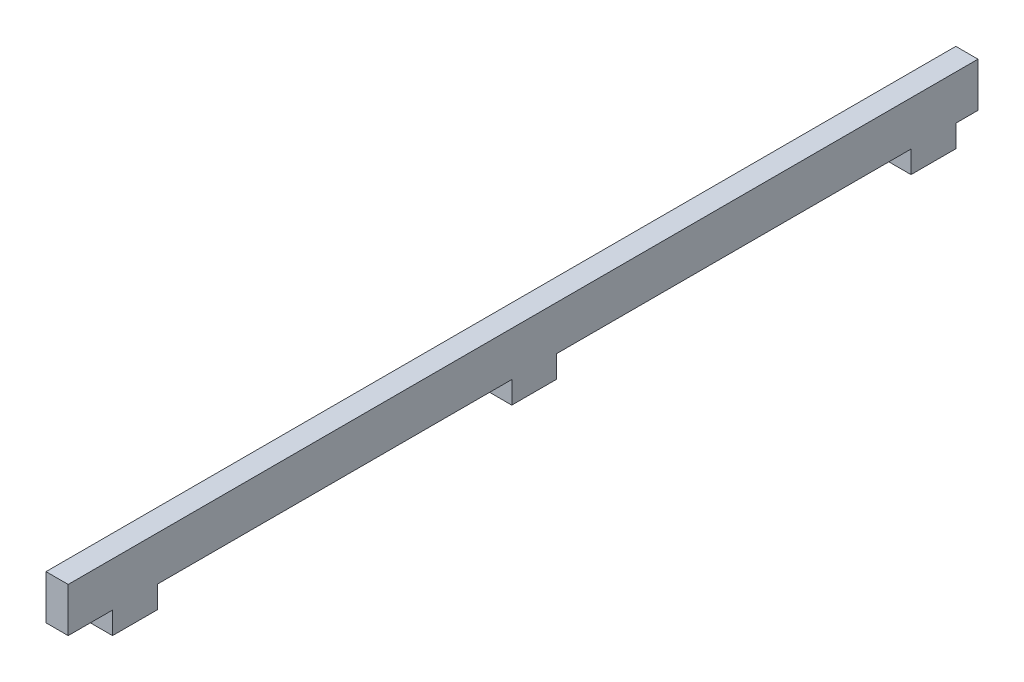
ISO-10303-21;
HEADER;
FILE_DESCRIPTION(('STEP AP214'),'2;1');
FILE_NAME('part.step','',(''),(''),'','','');
FILE_SCHEMA(('AUTOMOTIVE_DESIGN { 1 0 10303 214 1 1 1 1 }'));
ENDSEC;
DATA;
#1=APPLICATION_CONTEXT('core data for automotive mechanical design processes');
#2=APPLICATION_PROTOCOL_DEFINITION('international standard','automotive_design',2000,#1);
#3=PRODUCT_CONTEXT('',#1,'mechanical');
#4=PRODUCT('Part','Part','',(#3));
#5=PRODUCT_RELATED_PRODUCT_CATEGORY('part','',(#4));
#6=PRODUCT_DEFINITION_FORMATION('','',#4);
#7=PRODUCT_DEFINITION_CONTEXT('part definition',#1,'design');
#8=PRODUCT_DEFINITION('design','',#6,#7);
#9=PRODUCT_DEFINITION_SHAPE('','',#8);
#10=(LENGTH_UNIT() NAMED_UNIT(*) SI_UNIT(.MILLI.,.METRE.));
#11=(NAMED_UNIT(*) PLANE_ANGLE_UNIT() SI_UNIT($,.RADIAN.));
#12=(NAMED_UNIT(*) SI_UNIT($,.STERADIAN.) SOLID_ANGLE_UNIT());
#13=UNCERTAINTY_MEASURE_WITH_UNIT(LENGTH_MEASURE(1.E-05),#10,'distance_accuracy_value','');
#14=(GEOMETRIC_REPRESENTATION_CONTEXT(3) GLOBAL_UNCERTAINTY_ASSIGNED_CONTEXT((#13)) GLOBAL_UNIT_ASSIGNED_CONTEXT((#10,
#11,#12)) REPRESENTATION_CONTEXT('',''));
#15=CARTESIAN_POINT('',(0.,0.,0.));
#16=DIRECTION('',(0.,0.,1.));
#17=DIRECTION('',(1.,0.,0.));
#18=AXIS2_PLACEMENT_3D('',#15,#16,#17);
#19=CARTESIAN_POINT('',(6.35,0.,0.));
#20=DIRECTION('',(0.,-1.,0.));
#21=DIRECTION('',(0.,0.,-1.));
#22=AXIS2_PLACEMENT_3D('',#19,#20,#21);
#23=PLANE('',#22);
#24=DIRECTION('',(0.,0.,1.));
#25=VECTOR('',#24,1.);
#26=CARTESIAN_POINT('',(0.,0.,0.));
#27=LINE('',#26,#25);
#28=CARTESIAN_POINT('',(0.,0.,-260.477));
#29=VERTEX_POINT('',#28);
#30=CARTESIAN_POINT('',(0.,0.,0.));
#31=VERTEX_POINT('',#30);
#32=EDGE_CURVE('E179',#29,#31,#27,.T.);
#33=ORIENTED_EDGE('',*,*,#32,.T.);
#34=DIRECTION('',(-1.,0.,0.));
#35=VECTOR('',#34,1.);
#36=CARTESIAN_POINT('',(6.35,0.,0.));
#37=LINE('',#36,#35);
#38=CARTESIAN_POINT('',(6.35,0.,0.));
#39=VERTEX_POINT('',#38);
#40=EDGE_CURVE('E11',#39,#31,#37,.T.);
#41=ORIENTED_EDGE('',*,*,#40,.F.);
#42=DIRECTION('',(0.,0.,1.));
#43=VECTOR('',#42,1.);
#44=CARTESIAN_POINT('',(6.35,0.,0.));
#45=LINE('',#44,#43);
#46=CARTESIAN_POINT('',(6.35,0.,-260.477));
#47=VERTEX_POINT('',#46);
#48=EDGE_CURVE('E209',#47,#39,#45,.T.);
#49=ORIENTED_EDGE('',*,*,#48,.F.);
#50=DIRECTION('',(-1.,0.,0.));
#51=VECTOR('',#50,1.);
#52=CARTESIAN_POINT('',(6.35,0.,-260.477));
#53=LINE('',#52,#51);
#54=EDGE_CURVE('E175',#47,#29,#53,.T.);
#55=ORIENTED_EDGE('',*,*,#54,.T.);
#56=EDGE_LOOP('',(#33,#41,#49,#55));
#57=FACE_BOUND('',#56,.T.);
#58=ADVANCED_FACE('F35',(#57),#23,.F.);
#59=CARTESIAN_POINT('',(6.35,0.,0.));
#60=DIRECTION('',(0.,0.,-1.));
#61=DIRECTION('',(0.,1.,0.));
#62=AXIS2_PLACEMENT_3D('',#59,#60,#61);
#63=PLANE('',#62);
#64=DIRECTION('',(0.,-1.,0.));
#65=VECTOR('',#64,1.);
#66=CARTESIAN_POINT('',(0.,0.,0.));
#67=LINE('',#66,#65);
#68=CARTESIAN_POINT('',(0.,-12.7,0.));
#69=VERTEX_POINT('',#68);
#70=EDGE_CURVE('E182',#31,#69,#67,.T.);
#71=ORIENTED_EDGE('',*,*,#70,.T.);
#72=DIRECTION('',(-1.,0.,0.));
#73=VECTOR('',#72,1.);
#74=CARTESIAN_POINT('',(6.35,-12.7,0.));
#75=LINE('',#74,#73);
#76=CARTESIAN_POINT('',(6.35,-12.7,0.));
#77=VERTEX_POINT('',#76);
#78=EDGE_CURVE('E43',#77,#69,#75,.T.);
#79=ORIENTED_EDGE('',*,*,#78,.F.);
#80=DIRECTION('',(0.,-1.,0.));
#81=VECTOR('',#80,1.);
#82=CARTESIAN_POINT('',(6.35,0.,0.));
#83=LINE('',#82,#81);
#84=EDGE_CURVE('E118',#39,#77,#83,.T.);
#85=ORIENTED_EDGE('',*,*,#84,.F.);
#86=ORIENTED_EDGE('',*,*,#40,.T.);
#87=EDGE_LOOP('',(#71,#79,#85,#86));
#88=FACE_BOUND('',#87,.T.);
#89=ADVANCED_FACE('F307',(#88),#63,.F.);
#90=CARTESIAN_POINT('',(6.35,-12.7,0.));
#91=DIRECTION('',(0.,1.,0.));
#92=DIRECTION('',(0.,0.,1.));
#93=AXIS2_PLACEMENT_3D('',#90,#91,#92);
#94=PLANE('',#93);
#95=DIRECTION('',(0.,0.,-1.));
#96=VECTOR('',#95,1.);
#97=CARTESIAN_POINT('',(0.,-12.7,0.));
#98=LINE('',#97,#96);
#99=CARTESIAN_POINT('',(0.,-12.7,-12.7));
#100=VERTEX_POINT('',#99);
#101=EDGE_CURVE('E184',#69,#100,#98,.T.);
#102=ORIENTED_EDGE('',*,*,#101,.T.);
#103=DIRECTION('',(-1.,0.,0.));
#104=VECTOR('',#103,1.);
#105=CARTESIAN_POINT('',(6.35,-12.7,-12.7));
#106=LINE('',#105,#104);
#107=CARTESIAN_POINT('',(6.35,-12.7,-12.7));
#108=VERTEX_POINT('',#107);
#109=EDGE_CURVE('E240',#108,#100,#106,.T.);
#110=ORIENTED_EDGE('',*,*,#109,.F.);
#111=DIRECTION('',(0.,0.,-1.));
#112=VECTOR('',#111,1.);
#113=CARTESIAN_POINT('',(6.35,-12.7,0.));
#114=LINE('',#113,#112);
#115=EDGE_CURVE('E248',#77,#108,#114,.T.);
#116=ORIENTED_EDGE('',*,*,#115,.F.);
#117=ORIENTED_EDGE('',*,*,#78,.T.);
#118=EDGE_LOOP('',(#102,#110,#116,#117));
#119=FACE_BOUND('',#118,.T.);
#120=ADVANCED_FACE('F246',(#119),#94,.F.);
#121=CARTESIAN_POINT('',(6.35,-12.7,-12.7));
#122=DIRECTION('',(0.,0.,-1.));
#123=DIRECTION('',(0.,1.,0.));
#124=AXIS2_PLACEMENT_3D('',#121,#122,#123);
#125=PLANE('',#124);
#126=DIRECTION('',(0.,-1.,0.));
#127=VECTOR('',#126,1.);
#128=CARTESIAN_POINT('',(0.,-12.7,-12.7));
#129=LINE('',#128,#127);
#130=CARTESIAN_POINT('',(0.,-19.05,-12.7));
#131=VERTEX_POINT('',#130);
#132=EDGE_CURVE('E186',#100,#131,#129,.T.);
#133=ORIENTED_EDGE('',*,*,#132,.T.);
#134=DIRECTION('',(-1.,0.,0.));
#135=VECTOR('',#134,1.);
#136=CARTESIAN_POINT('',(6.35,-19.05,-12.7));
#137=LINE('',#136,#135);
#138=CARTESIAN_POINT('',(6.35,-19.05,-12.7));
#139=VERTEX_POINT('',#138);
#140=EDGE_CURVE('E237',#139,#131,#137,.T.);
#141=ORIENTED_EDGE('',*,*,#140,.F.);
#142=DIRECTION('',(0.,-1.,0.));
#143=VECTOR('',#142,1.);
#144=CARTESIAN_POINT('',(6.35,-12.7,-12.7));
#145=LINE('',#144,#143);
#146=EDGE_CURVE('E266',#108,#139,#145,.T.);
#147=ORIENTED_EDGE('',*,*,#146,.F.);
#148=ORIENTED_EDGE('',*,*,#109,.T.);
#149=EDGE_LOOP('',(#133,#141,#147,#148));
#150=FACE_BOUND('',#149,.T.);
#151=ADVANCED_FACE('F257',(#150),#125,.F.);
#152=CARTESIAN_POINT('',(6.35,-19.05,-12.7));
#153=DIRECTION('',(0.,1.,0.));
#154=DIRECTION('',(0.,0.,1.));
#155=AXIS2_PLACEMENT_3D('',#152,#153,#154);
#156=PLANE('',#155);
#157=DIRECTION('',(0.,0.,-1.));
#158=VECTOR('',#157,1.);
#159=CARTESIAN_POINT('',(0.,-19.05,-12.7));
#160=LINE('',#159,#158);
#161=CARTESIAN_POINT('',(0.,-19.05,-25.527));
#162=VERTEX_POINT('',#161);
#163=EDGE_CURVE('E188',#131,#162,#160,.T.);
#164=ORIENTED_EDGE('',*,*,#163,.T.);
#165=DIRECTION('',(-1.,0.,0.));
#166=VECTOR('',#165,1.);
#167=CARTESIAN_POINT('',(6.35,-19.05,-25.527));
#168=LINE('',#167,#166);
#169=CARTESIAN_POINT('',(6.35,-19.05,-25.527));
#170=VERTEX_POINT('',#169);
#171=EDGE_CURVE('E234',#170,#162,#168,.T.);
#172=ORIENTED_EDGE('',*,*,#171,.F.);
#173=DIRECTION('',(0.,0.,-1.));
#174=VECTOR('',#173,1.);
#175=CARTESIAN_POINT('',(6.35,-19.05,-12.7));
#176=LINE('',#175,#174);
#177=EDGE_CURVE('E263',#139,#170,#176,.T.);
#178=ORIENTED_EDGE('',*,*,#177,.F.);
#179=ORIENTED_EDGE('',*,*,#140,.T.);
#180=EDGE_LOOP('',(#164,#172,#178,#179));
#181=FACE_BOUND('',#180,.T.);
#182=ADVANCED_FACE('F261',(#181),#156,.F.);
#183=CARTESIAN_POINT('',(6.35,-19.05,-25.527));
#184=DIRECTION('',(0.,0.,1.));
#185=DIRECTION('',(1.,0.,0.));
#186=AXIS2_PLACEMENT_3D('',#183,#184,#185);
#187=PLANE('',#186);
#188=DIRECTION('',(0.,1.,0.));
#189=VECTOR('',#188,1.);
#190=CARTESIAN_POINT('',(0.,-19.05,-25.527));
#191=LINE('',#190,#189);
#192=CARTESIAN_POINT('',(0.,-12.7,-25.527));
#193=VERTEX_POINT('',#192);
#194=EDGE_CURVE('E190',#162,#193,#191,.T.);
#195=ORIENTED_EDGE('',*,*,#194,.T.);
#196=DIRECTION('',(-1.,0.,0.));
#197=VECTOR('',#196,1.);
#198=CARTESIAN_POINT('',(6.35,-12.7,-25.527));
#199=LINE('',#198,#197);
#200=CARTESIAN_POINT('',(6.35,-12.7,-25.527));
#201=VERTEX_POINT('',#200);
#202=EDGE_CURVE('E231',#201,#193,#199,.T.);
#203=ORIENTED_EDGE('',*,*,#202,.F.);
#204=DIRECTION('',(0.,1.,0.));
#205=VECTOR('',#204,1.);
#206=CARTESIAN_POINT('',(6.35,-19.05,-25.527));
#207=LINE('',#206,#205);
#208=EDGE_CURVE('E265',#170,#201,#207,.T.);
#209=ORIENTED_EDGE('',*,*,#208,.F.);
#210=ORIENTED_EDGE('',*,*,#171,.T.);
#211=EDGE_LOOP('',(#195,#203,#209,#210));
#212=FACE_BOUND('',#211,.T.);
#213=ADVANCED_FACE('F320',(#212),#187,.F.);
#214=CARTESIAN_POINT('',(6.35,-12.7,-25.527));
#215=DIRECTION('',(0.,1.,0.));
#216=DIRECTION('',(0.,0.,1.));
#217=AXIS2_PLACEMENT_3D('',#214,#215,#216);
#218=PLANE('',#217);
#219=DIRECTION('',(0.,0.,-1.));
#220=VECTOR('',#219,1.);
#221=CARTESIAN_POINT('',(0.,-12.7,-25.527));
#222=LINE('',#221,#220);
#223=CARTESIAN_POINT('',(0.,-12.7,-127.));
#224=VERTEX_POINT('',#223);
#225=EDGE_CURVE('E192',#193,#224,#222,.T.);
#226=ORIENTED_EDGE('',*,*,#225,.T.);
#227=DIRECTION('',(-1.,0.,0.));
#228=VECTOR('',#227,1.);
#229=CARTESIAN_POINT('',(6.35,-12.7,-127.));
#230=LINE('',#229,#228);
#231=CARTESIAN_POINT('',(6.35,-12.7,-127.));
#232=VERTEX_POINT('',#231);
#233=EDGE_CURVE('E228',#232,#224,#230,.T.);
#234=ORIENTED_EDGE('',*,*,#233,.F.);
#235=DIRECTION('',(0.,0.,-1.));
#236=VECTOR('',#235,1.);
#237=CARTESIAN_POINT('',(6.35,-12.7,-25.527));
#238=LINE('',#237,#236);
#239=EDGE_CURVE('E268',#201,#232,#238,.T.);
#240=ORIENTED_EDGE('',*,*,#239,.F.);
#241=ORIENTED_EDGE('',*,*,#202,.T.);
#242=EDGE_LOOP('',(#226,#234,#240,#241));
#243=FACE_BOUND('',#242,.T.);
#244=ADVANCED_FACE('F323',(#243),#218,.F.);
#245=CARTESIAN_POINT('',(6.35,-12.7,-127.));
#246=DIRECTION('',(0.,0.,-1.));
#247=DIRECTION('',(0.,1.,0.));
#248=AXIS2_PLACEMENT_3D('',#245,#246,#247);
#249=PLANE('',#248);
#250=DIRECTION('',(0.,-1.,0.));
#251=VECTOR('',#250,1.);
#252=CARTESIAN_POINT('',(0.,-12.7,-127.));
#253=LINE('',#252,#251);
#254=CARTESIAN_POINT('',(0.,-19.05,-127.));
#255=VERTEX_POINT('',#254);
#256=EDGE_CURVE('E194',#224,#255,#253,.T.);
#257=ORIENTED_EDGE('',*,*,#256,.T.);
#258=DIRECTION('',(-1.,0.,0.));
#259=VECTOR('',#258,1.);
#260=CARTESIAN_POINT('',(6.35,-19.05,-127.));
#261=LINE('',#260,#259);
#262=CARTESIAN_POINT('',(6.35,-19.05,-127.));
#263=VERTEX_POINT('',#262);
#264=EDGE_CURVE('E225',#263,#255,#261,.T.);
#265=ORIENTED_EDGE('',*,*,#264,.F.);
#266=DIRECTION('',(0.,-1.,0.));
#267=VECTOR('',#266,1.);
#268=CARTESIAN_POINT('',(6.35,-12.7,-127.));
#269=LINE('',#268,#267);
#270=EDGE_CURVE('E274',#232,#263,#269,.T.);
#271=ORIENTED_EDGE('',*,*,#270,.F.);
#272=ORIENTED_EDGE('',*,*,#233,.T.);
#273=EDGE_LOOP('',(#257,#265,#271,#272));
#274=FACE_BOUND('',#273,.T.);
#275=ADVANCED_FACE('F327',(#274),#249,.F.);
#276=CARTESIAN_POINT('',(6.35,-19.05,-127.));
#277=DIRECTION('',(0.,1.,0.));
#278=DIRECTION('',(0.,0.,1.));
#279=AXIS2_PLACEMENT_3D('',#276,#277,#278);
#280=PLANE('',#279);
#281=DIRECTION('',(0.,0.,-1.));
#282=VECTOR('',#281,1.);
#283=CARTESIAN_POINT('',(0.,-19.05,-127.));
#284=LINE('',#283,#282);
#285=CARTESIAN_POINT('',(0.,-19.05,-139.827));
#286=VERTEX_POINT('',#285);
#287=EDGE_CURVE('E196',#255,#286,#284,.T.);
#288=ORIENTED_EDGE('',*,*,#287,.T.);
#289=DIRECTION('',(-1.,0.,0.));
#290=VECTOR('',#289,1.);
#291=CARTESIAN_POINT('',(6.35,-19.05,-139.827));
#292=LINE('',#291,#290);
#293=CARTESIAN_POINT('',(6.35,-19.05,-139.827));
#294=VERTEX_POINT('',#293);
#295=EDGE_CURVE('E222',#294,#286,#292,.T.);
#296=ORIENTED_EDGE('',*,*,#295,.F.);
#297=DIRECTION('',(0.,0.,-1.));
#298=VECTOR('',#297,1.);
#299=CARTESIAN_POINT('',(6.35,-19.05,-127.));
#300=LINE('',#299,#298);
#301=EDGE_CURVE('E276',#263,#294,#300,.T.);
#302=ORIENTED_EDGE('',*,*,#301,.F.);
#303=ORIENTED_EDGE('',*,*,#264,.T.);
#304=EDGE_LOOP('',(#288,#296,#302,#303));
#305=FACE_BOUND('',#304,.T.);
#306=ADVANCED_FACE('F331',(#305),#280,.F.);
#307=CARTESIAN_POINT('',(6.35,-19.05,-139.827));
#308=DIRECTION('',(0.,0.,1.));
#309=DIRECTION('',(1.,0.,0.));
#310=AXIS2_PLACEMENT_3D('',#307,#308,#309);
#311=PLANE('',#310);
#312=DIRECTION('',(0.,1.,0.));
#313=VECTOR('',#312,1.);
#314=CARTESIAN_POINT('',(0.,-19.05,-139.827));
#315=LINE('',#314,#313);
#316=CARTESIAN_POINT('',(0.,-12.7,-139.827));
#317=VERTEX_POINT('',#316);
#318=EDGE_CURVE('E198',#286,#317,#315,.T.);
#319=ORIENTED_EDGE('',*,*,#318,.T.);
#320=DIRECTION('',(-1.,0.,0.));
#321=VECTOR('',#320,1.);
#322=CARTESIAN_POINT('',(6.35,-12.7,-139.827));
#323=LINE('',#322,#321);
#324=CARTESIAN_POINT('',(6.35,-12.7,-139.827));
#325=VERTEX_POINT('',#324);
#326=EDGE_CURVE('E219',#325,#317,#323,.T.);
#327=ORIENTED_EDGE('',*,*,#326,.F.);
#328=DIRECTION('',(0.,1.,0.));
#329=VECTOR('',#328,1.);
#330=CARTESIAN_POINT('',(6.35,-19.05,-139.827));
#331=LINE('',#330,#329);
#332=EDGE_CURVE('E278',#294,#325,#331,.T.);
#333=ORIENTED_EDGE('',*,*,#332,.F.);
#334=ORIENTED_EDGE('',*,*,#295,.T.);
#335=EDGE_LOOP('',(#319,#327,#333,#334));
#336=FACE_BOUND('',#335,.T.);
#337=ADVANCED_FACE('F335',(#336),#311,.F.);
#338=CARTESIAN_POINT('',(6.35,-12.7,-139.827));
#339=DIRECTION('',(0.,1.,0.));
#340=DIRECTION('',(0.,0.,1.));
#341=AXIS2_PLACEMENT_3D('',#338,#339,#340);
#342=PLANE('',#341);
#343=DIRECTION('',(0.,0.,-1.));
#344=VECTOR('',#343,1.);
#345=CARTESIAN_POINT('',(0.,-12.7,-139.827));
#346=LINE('',#345,#344);
#347=CARTESIAN_POINT('',(0.,-12.7,-241.3));
#348=VERTEX_POINT('',#347);
#349=EDGE_CURVE('E200',#317,#348,#346,.T.);
#350=ORIENTED_EDGE('',*,*,#349,.T.);
#351=DIRECTION('',(-1.,0.,0.));
#352=VECTOR('',#351,1.);
#353=CARTESIAN_POINT('',(6.35,-12.7,-241.3));
#354=LINE('',#353,#352);
#355=CARTESIAN_POINT('',(6.35,-12.7,-241.3));
#356=VERTEX_POINT('',#355);
#357=EDGE_CURVE('E216',#356,#348,#354,.T.);
#358=ORIENTED_EDGE('',*,*,#357,.F.);
#359=DIRECTION('',(0.,0.,-1.));
#360=VECTOR('',#359,1.);
#361=CARTESIAN_POINT('',(6.35,-12.7,-139.827));
#362=LINE('',#361,#360);
#363=EDGE_CURVE('E280',#325,#356,#362,.T.);
#364=ORIENTED_EDGE('',*,*,#363,.F.);
#365=ORIENTED_EDGE('',*,*,#326,.T.);
#366=EDGE_LOOP('',(#350,#358,#364,#365));
#367=FACE_BOUND('',#366,.T.);
#368=ADVANCED_FACE('F339',(#367),#342,.F.);
#369=CARTESIAN_POINT('',(6.35,-12.7,-241.3));
#370=DIRECTION('',(0.,0.,-1.));
#371=DIRECTION('',(0.,1.,0.));
#372=AXIS2_PLACEMENT_3D('',#369,#370,#371);
#373=PLANE('',#372);
#374=DIRECTION('',(0.,-1.,0.));
#375=VECTOR('',#374,1.);
#376=CARTESIAN_POINT('',(0.,-12.7,-241.3));
#377=LINE('',#376,#375);
#378=CARTESIAN_POINT('',(0.,-19.05,-241.3));
#379=VERTEX_POINT('',#378);
#380=EDGE_CURVE('E202',#348,#379,#377,.T.);
#381=ORIENTED_EDGE('',*,*,#380,.T.);
#382=DIRECTION('',(-1.,0.,0.));
#383=VECTOR('',#382,1.);
#384=CARTESIAN_POINT('',(6.35,-19.05,-241.3));
#385=LINE('',#384,#383);
#386=CARTESIAN_POINT('',(6.35,-19.05,-241.3));
#387=VERTEX_POINT('',#386);
#388=EDGE_CURVE('E213',#387,#379,#385,.T.);
#389=ORIENTED_EDGE('',*,*,#388,.F.);
#390=DIRECTION('',(0.,-1.,0.));
#391=VECTOR('',#390,1.);
#392=CARTESIAN_POINT('',(6.35,-12.7,-241.3));
#393=LINE('',#392,#391);
#394=EDGE_CURVE('E282',#356,#387,#393,.T.);
#395=ORIENTED_EDGE('',*,*,#394,.F.);
#396=ORIENTED_EDGE('',*,*,#357,.T.);
#397=EDGE_LOOP('',(#381,#389,#395,#396));
#398=FACE_BOUND('',#397,.T.);
#399=ADVANCED_FACE('F288',(#398),#373,.F.);
#400=CARTESIAN_POINT('',(6.35,-19.05,-241.3));
#401=DIRECTION('',(0.,1.,0.));
#402=DIRECTION('',(0.,0.,1.));
#403=AXIS2_PLACEMENT_3D('',#400,#401,#402);
#404=PLANE('',#403);
#405=DIRECTION('',(0.,0.,-1.));
#406=VECTOR('',#405,1.);
#407=CARTESIAN_POINT('',(0.,-19.05,-241.3));
#408=LINE('',#407,#406);
#409=CARTESIAN_POINT('',(0.,-19.05,-254.127));
#410=VERTEX_POINT('',#409);
#411=EDGE_CURVE('E204',#379,#410,#408,.T.);
#412=ORIENTED_EDGE('',*,*,#411,.T.);
#413=DIRECTION('',(-1.,0.,0.));
#414=VECTOR('',#413,1.);
#415=CARTESIAN_POINT('',(6.35,-19.05,-254.127));
#416=LINE('',#415,#414);
#417=CARTESIAN_POINT('',(6.35,-19.05,-254.127));
#418=VERTEX_POINT('',#417);
#419=EDGE_CURVE('E170',#418,#410,#416,.T.);
#420=ORIENTED_EDGE('',*,*,#419,.F.);
#421=DIRECTION('',(0.,0.,-1.));
#422=VECTOR('',#421,1.);
#423=CARTESIAN_POINT('',(6.35,-19.05,-241.3));
#424=LINE('',#423,#422);
#425=EDGE_CURVE('E161',#387,#418,#424,.T.);
#426=ORIENTED_EDGE('',*,*,#425,.F.);
#427=ORIENTED_EDGE('',*,*,#388,.T.);
#428=EDGE_LOOP('',(#412,#420,#426,#427));
#429=FACE_BOUND('',#428,.T.);
#430=ADVANCED_FACE('F292',(#429),#404,.F.);
#431=CARTESIAN_POINT('',(6.35,-19.05,-254.127));
#432=DIRECTION('',(0.,0.,1.));
#433=DIRECTION('',(1.,0.,0.));
#434=AXIS2_PLACEMENT_3D('',#431,#432,#433);
#435=PLANE('',#434);
#436=DIRECTION('',(0.,1.,0.));
#437=VECTOR('',#436,1.);
#438=CARTESIAN_POINT('',(0.,-19.05,-254.127));
#439=LINE('',#438,#437);
#440=CARTESIAN_POINT('',(0.,-12.7,-254.127));
#441=VERTEX_POINT('',#440);
#442=EDGE_CURVE('E169',#410,#441,#439,.T.);
#443=ORIENTED_EDGE('',*,*,#442,.T.);
#444=DIRECTION('',(-1.,0.,0.));
#445=VECTOR('',#444,1.);
#446=CARTESIAN_POINT('',(6.35,-12.7,-254.127));
#447=LINE('',#446,#445);
#448=CARTESIAN_POINT('',(6.35,-12.7,-254.127));
#449=VERTEX_POINT('',#448);
#450=EDGE_CURVE('E166',#449,#441,#447,.T.);
#451=ORIENTED_EDGE('',*,*,#450,.F.);
#452=DIRECTION('',(0.,1.,0.));
#453=VECTOR('',#452,1.);
#454=CARTESIAN_POINT('',(6.35,-19.05,-254.127));
#455=LINE('',#454,#453);
#456=EDGE_CURVE('E155',#418,#449,#455,.T.);
#457=ORIENTED_EDGE('',*,*,#456,.F.);
#458=ORIENTED_EDGE('',*,*,#419,.T.);
#459=EDGE_LOOP('',(#443,#451,#457,#458));
#460=FACE_BOUND('',#459,.T.);
#461=ADVANCED_FACE('F167',(#460),#435,.F.);
#462=CARTESIAN_POINT('',(6.35,-12.7,-254.127));
#463=DIRECTION('',(0.,1.,0.));
#464=DIRECTION('',(0.,0.,1.));
#465=AXIS2_PLACEMENT_3D('',#462,#463,#464);
#466=PLANE('',#465);
#467=DIRECTION('',(0.,0.,-1.));
#468=VECTOR('',#467,1.);
#469=CARTESIAN_POINT('',(0.,-12.7,-254.127));
#470=LINE('',#469,#468);
#471=CARTESIAN_POINT('',(0.,-12.7,-260.477));
#472=VERTEX_POINT('',#471);
#473=EDGE_CURVE('E104',#441,#472,#470,.T.);
#474=ORIENTED_EDGE('',*,*,#473,.T.);
#475=DIRECTION('',(-1.,0.,0.));
#476=VECTOR('',#475,1.);
#477=CARTESIAN_POINT('',(6.35,-12.7,-260.477));
#478=LINE('',#477,#476);
#479=CARTESIAN_POINT('',(6.35,-12.7,-260.477));
#480=VERTEX_POINT('',#479);
#481=EDGE_CURVE('E171',#480,#472,#478,.T.);
#482=ORIENTED_EDGE('',*,*,#481,.F.);
#483=DIRECTION('',(0.,0.,-1.));
#484=VECTOR('',#483,1.);
#485=CARTESIAN_POINT('',(6.35,-12.7,-254.127));
#486=LINE('',#485,#484);
#487=EDGE_CURVE('E159',#449,#480,#486,.T.);
#488=ORIENTED_EDGE('',*,*,#487,.F.);
#489=ORIENTED_EDGE('',*,*,#450,.T.);
#490=EDGE_LOOP('',(#474,#482,#488,#489));
#491=FACE_BOUND('',#490,.T.);
#492=ADVANCED_FACE('F173',(#491),#466,.F.);
#493=CARTESIAN_POINT('',(6.35,0.,-260.477));
#494=DIRECTION('',(0.,0.,1.));
#495=DIRECTION('',(1.,0.,0.));
#496=AXIS2_PLACEMENT_3D('',#493,#494,#495);
#497=PLANE('',#496);
#498=DIRECTION('',(0.,1.,0.));
#499=VECTOR('',#498,1.);
#500=CARTESIAN_POINT('',(0.,0.,-260.477));
#501=LINE('',#500,#499);
#502=EDGE_CURVE('E110',#472,#29,#501,.T.);
#503=ORIENTED_EDGE('',*,*,#502,.T.);
#504=ORIENTED_EDGE('',*,*,#54,.F.);
#505=DIRECTION('',(0.,1.,0.));
#506=VECTOR('',#505,1.);
#507=CARTESIAN_POINT('',(6.35,0.,-260.477));
#508=LINE('',#507,#506);
#509=EDGE_CURVE('E51',#480,#47,#508,.T.);
#510=ORIENTED_EDGE('',*,*,#509,.F.);
#511=ORIENTED_EDGE('',*,*,#481,.T.);
#512=EDGE_LOOP('',(#503,#504,#510,#511));
#513=FACE_BOUND('',#512,.T.);
#514=ADVANCED_FACE('F296',(#513),#497,.F.);
#515=CARTESIAN_POINT('',(6.35,0.,0.));
#516=DIRECTION('',(-1.,0.,0.));
#517=DIRECTION('',(0.,0.,1.));
#518=AXIS2_PLACEMENT_3D('',#515,#516,#517);
#519=PLANE('',#518);
#520=ORIENTED_EDGE('',*,*,#48,.T.);
#521=ORIENTED_EDGE('',*,*,#84,.T.);
#522=ORIENTED_EDGE('',*,*,#115,.T.);
#523=ORIENTED_EDGE('',*,*,#146,.T.);
#524=ORIENTED_EDGE('',*,*,#177,.T.);
#525=ORIENTED_EDGE('',*,*,#208,.T.);
#526=ORIENTED_EDGE('',*,*,#239,.T.);
#527=ORIENTED_EDGE('',*,*,#270,.T.);
#528=ORIENTED_EDGE('',*,*,#301,.T.);
#529=ORIENTED_EDGE('',*,*,#332,.T.);
#530=ORIENTED_EDGE('',*,*,#363,.T.);
#531=ORIENTED_EDGE('',*,*,#394,.T.);
#532=ORIENTED_EDGE('',*,*,#425,.T.);
#533=ORIENTED_EDGE('',*,*,#456,.T.);
#534=ORIENTED_EDGE('',*,*,#487,.T.);
#535=ORIENTED_EDGE('',*,*,#509,.T.);
#536=EDGE_LOOP('',(#520,#521,#522,#523,#524,#525,#526,#527,#528,#529,#530,#531,#532,#533,#534,#535));
#537=FACE_BOUND('',#536,.T.);
#538=ADVANCED_FACE('F157',(#537),#519,.F.);
#539=CARTESIAN_POINT('',(0.,0.,0.));
#540=DIRECTION('',(-1.,0.,0.));
#541=DIRECTION('',(0.,0.,1.));
#542=AXIS2_PLACEMENT_3D('',#539,#540,#541);
#543=PLANE('',#542);
#544=ORIENTED_EDGE('',*,*,#32,.F.);
#545=ORIENTED_EDGE('',*,*,#502,.F.);
#546=ORIENTED_EDGE('',*,*,#473,.F.);
#547=ORIENTED_EDGE('',*,*,#442,.F.);
#548=ORIENTED_EDGE('',*,*,#411,.F.);
#549=ORIENTED_EDGE('',*,*,#380,.F.);
#550=ORIENTED_EDGE('',*,*,#349,.F.);
#551=ORIENTED_EDGE('',*,*,#318,.F.);
#552=ORIENTED_EDGE('',*,*,#287,.F.);
#553=ORIENTED_EDGE('',*,*,#256,.F.);
#554=ORIENTED_EDGE('',*,*,#225,.F.);
#555=ORIENTED_EDGE('',*,*,#194,.F.);
#556=ORIENTED_EDGE('',*,*,#163,.F.);
#557=ORIENTED_EDGE('',*,*,#132,.F.);
#558=ORIENTED_EDGE('',*,*,#101,.F.);
#559=ORIENTED_EDGE('',*,*,#70,.F.);
#560=EDGE_LOOP('',(#544,#545,#546,#547,#548,#549,#550,#551,#552,#553,#554,#555,#556,#557,#558,#559));
#561=FACE_BOUND('',#560,.T.);
#562=ADVANCED_FACE('F252',(#561),#543,.T.);
#563=CLOSED_SHELL('',(#58,#89,#120,#151,#182,#213,#244,#275,#306,#337,#368,#399,#430,#461,#492,
#514,#538,#562));
#564=MANIFOLD_SOLID_BREP('B2',#563);
#565=ADVANCED_BREP_SHAPE_REPRESENTATION('',(#18,#564),#14);
#566=SHAPE_DEFINITION_REPRESENTATION(#9,#565);
ENDSEC;
END-ISO-10303-21;
